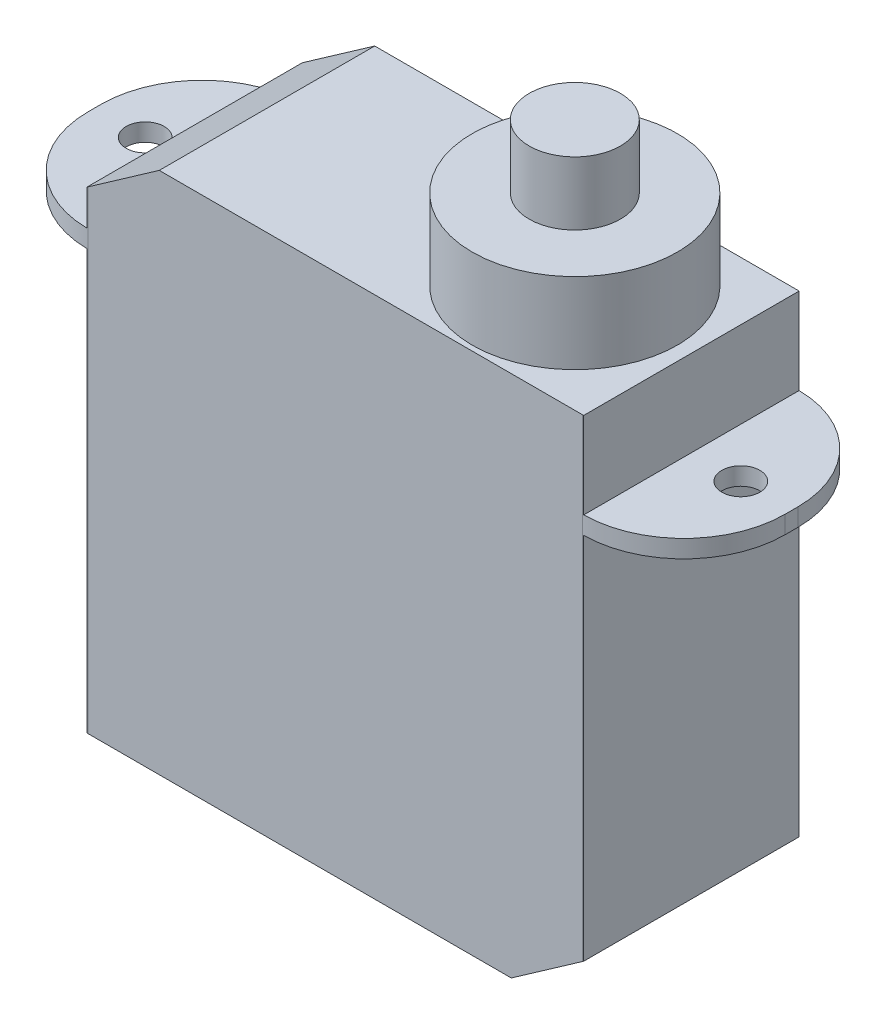
ISO-10303-21;
HEADER;
FILE_DESCRIPTION(('STEP AP214'),'2;1');
FILE_NAME('part.step','',(''),(''),'','','');
FILE_SCHEMA(('AUTOMOTIVE_DESIGN { 1 0 10303 214 1 1 1 1 }'));
ENDSEC;
DATA;
#1=APPLICATION_CONTEXT('core data for automotive mechanical design processes');
#2=APPLICATION_PROTOCOL_DEFINITION('international standard','automotive_design',2000,#1);
#3=PRODUCT_CONTEXT('',#1,'mechanical');
#4=PRODUCT('Part','Part','',(#3));
#5=PRODUCT_RELATED_PRODUCT_CATEGORY('part','',(#4));
#6=PRODUCT_DEFINITION_FORMATION('','',#4);
#7=PRODUCT_DEFINITION_CONTEXT('part definition',#1,'design');
#8=PRODUCT_DEFINITION('design','',#6,#7);
#9=PRODUCT_DEFINITION_SHAPE('','',#8);
#10=(LENGTH_UNIT() NAMED_UNIT(*) SI_UNIT(.MILLI.,.METRE.));
#11=(NAMED_UNIT(*) PLANE_ANGLE_UNIT() SI_UNIT($,.RADIAN.));
#12=(NAMED_UNIT(*) SI_UNIT($,.STERADIAN.) SOLID_ANGLE_UNIT());
#13=UNCERTAINTY_MEASURE_WITH_UNIT(LENGTH_MEASURE(1.E-05),#10,'distance_accuracy_value','');
#14=(GEOMETRIC_REPRESENTATION_CONTEXT(3) GLOBAL_UNCERTAINTY_ASSIGNED_CONTEXT((#13)) GLOBAL_UNIT_ASSIGNED_CONTEXT((#10,
#11,#12)) REPRESENTATION_CONTEXT('',''));
#15=CARTESIAN_POINT('',(0.,0.,0.));
#16=DIRECTION('',(0.,0.,1.));
#17=DIRECTION('',(1.,0.,0.));
#18=AXIS2_PLACEMENT_3D('',#15,#16,#17);
#19=CARTESIAN_POINT('',(-9.8,3.4,-4.25));
#20=DIRECTION('',(1.,0.,0.));
#21=DIRECTION('',(0.,0.,-1.));
#22=AXIS2_PLACEMENT_3D('',#19,#20,#21);
#23=PLANE('',#22);
#24=DIRECTION('',(0.,-1.,0.));
#25=VECTOR('',#24,1.);
#26=CARTESIAN_POINT('',(-9.8,0.,4.24968748779202));
#27=LINE('',#26,#25);
#28=CARTESIAN_POINT('',(-9.8,0.,4.24968748779202));
#29=VERTEX_POINT('',#28);
#30=CARTESIAN_POINT('',(-9.8,1.39999999999999,4.24968748779202));
#31=VERTEX_POINT('',#30);
#32=EDGE_CURVE('E202',#29,#31,#27,.F.);
#33=ORIENTED_EDGE('',*,*,#32,.T.);
#34=DIRECTION('',(0.,0.,-1.));
#35=VECTOR('',#34,1.);
#36=CARTESIAN_POINT('',(-9.8,1.39999999999999,-4.24968748779201));
#37=LINE('',#36,#35);
#38=CARTESIAN_POINT('',(-9.8,1.39999999999999,-4.24968748779202));
#39=VERTEX_POINT('',#38);
#40=EDGE_CURVE('E49',#31,#39,#37,.T.);
#41=ORIENTED_EDGE('',*,*,#40,.T.);
#42=DIRECTION('',(0.,-1.,0.));
#43=VECTOR('',#42,1.);
#44=CARTESIAN_POINT('',(-9.8,3.4,-4.24968748779202));
#45=LINE('',#44,#43);
#46=CARTESIAN_POINT('',(-9.8,0.,-4.24968748779202));
#47=VERTEX_POINT('',#46);
#48=EDGE_CURVE('E204',#39,#47,#45,.T.);
#49=ORIENTED_EDGE('',*,*,#48,.T.);
#50=DIRECTION('',(0.,0.,-1.));
#51=VECTOR('',#50,1.);
#52=CARTESIAN_POINT('',(-9.8,0.,-4.25));
#53=LINE('',#52,#51);
#54=EDGE_CURVE('E319',#29,#47,#53,.T.);
#55=ORIENTED_EDGE('',*,*,#54,.F.);
#56=EDGE_LOOP('',(#33,#41,#49,#55));
#57=FACE_BOUND('',#56,.T.);
#58=ADVANCED_FACE('F40',(#57),#23,.F.);
#59=CARTESIAN_POINT('',(9.8,3.4,-4.25));
#60=DIRECTION('',(-1.,0.,0.));
#61=DIRECTION('',(0.,0.,1.));
#62=AXIS2_PLACEMENT_3D('',#59,#60,#61);
#63=PLANE('',#62);
#64=DIRECTION('',(0.,0.,1.));
#65=VECTOR('',#64,1.);
#66=CARTESIAN_POINT('',(9.8,0.,-4.25));
#67=LINE('',#66,#65);
#68=CARTESIAN_POINT('',(9.8,0.,-4.24968748779202));
#69=VERTEX_POINT('',#68);
#70=CARTESIAN_POINT('',(9.8,0.,4.24968748779202));
#71=VERTEX_POINT('',#70);
#72=EDGE_CURVE('E301',#69,#71,#67,.T.);
#73=ORIENTED_EDGE('',*,*,#72,.F.);
#74=DIRECTION('',(0.,-1.,0.));
#75=VECTOR('',#74,1.);
#76=CARTESIAN_POINT('',(9.8,0.,-4.24968748779202));
#77=LINE('',#76,#75);
#78=CARTESIAN_POINT('',(9.8,3.4,-4.24968748779202));
#79=VERTEX_POINT('',#78);
#80=EDGE_CURVE('E238',#69,#79,#77,.F.);
#81=ORIENTED_EDGE('',*,*,#80,.T.);
#82=DIRECTION('',(0.,0.,-1.));
#83=VECTOR('',#82,1.);
#84=CARTESIAN_POINT('',(9.8,3.4,-4.25));
#85=LINE('',#84,#83);
#86=CARTESIAN_POINT('',(9.8,3.4,4.24968748779202));
#87=VERTEX_POINT('',#86);
#88=EDGE_CURVE('E286',#87,#79,#85,.T.);
#89=ORIENTED_EDGE('',*,*,#88,.F.);
#90=DIRECTION('',(0.,-1.,0.));
#91=VECTOR('',#90,1.);
#92=CARTESIAN_POINT('',(9.8,3.4,4.24968748779202));
#93=LINE('',#92,#91);
#94=EDGE_CURVE('E236',#87,#71,#93,.T.);
#95=ORIENTED_EDGE('',*,*,#94,.T.);
#96=EDGE_LOOP('',(#73,#81,#89,#95));
#97=FACE_BOUND('',#96,.T.);
#98=ADVANCED_FACE('F370',(#97),#63,.F.);
#99=DIRECTION('',(0.,-1.,0.));
#100=VECTOR('',#99,1.);
#101=CARTESIAN_POINT('',(9.8,-0.7,4.24968748779202));
#102=LINE('',#101,#100);
#103=CARTESIAN_POINT('',(9.8,-0.7,4.24968748779202));
#104=VERTEX_POINT('',#103);
#105=CARTESIAN_POINT('',(9.8,-15.25,4.24968748779202));
#106=VERTEX_POINT('',#105);
#107=EDGE_CURVE('E240',#104,#106,#102,.T.);
#108=ORIENTED_EDGE('',*,*,#107,.T.);
#109=DIRECTION('',(0.,0.,-1.));
#110=VECTOR('',#109,1.);
#111=CARTESIAN_POINT('',(9.8,-15.25,-4.25));
#112=LINE('',#111,#110);
#113=CARTESIAN_POINT('',(9.8,-15.25,-4.24968748779202));
#114=VERTEX_POINT('',#113);
#115=EDGE_CURVE('E250',#106,#114,#112,.T.);
#116=ORIENTED_EDGE('',*,*,#115,.T.);
#117=DIRECTION('',(0.,-1.,0.));
#118=VECTOR('',#117,1.);
#119=CARTESIAN_POINT('',(9.8,-17.25,-4.24968748779202));
#120=LINE('',#119,#118);
#121=CARTESIAN_POINT('',(9.8,-0.7,-4.24968748779202));
#122=VERTEX_POINT('',#121);
#123=EDGE_CURVE('E243',#114,#122,#120,.F.);
#124=ORIENTED_EDGE('',*,*,#123,.T.);
#125=DIRECTION('',(0.,0.,1.));
#126=VECTOR('',#125,1.);
#127=CARTESIAN_POINT('',(9.8,-0.7,-4.25));
#128=LINE('',#127,#126);
#129=EDGE_CURVE('E300',#122,#104,#128,.T.);
#130=ORIENTED_EDGE('',*,*,#129,.T.);
#131=EDGE_LOOP('',(#108,#116,#124,#130));
#132=FACE_BOUND('',#131,.T.);
#133=ADVANCED_FACE('F375',(#132),#63,.F.);
#134=CARTESIAN_POINT('',(-9.8,3.4,-4.25));
#135=DIRECTION('',(0.,0.,1.));
#136=DIRECTION('',(1.,0.,0.));
#137=AXIS2_PLACEMENT_3D('',#134,#135,#136);
#138=PLANE('',#137);
#139=DIRECTION('',(0.,1.,0.));
#140=VECTOR('',#139,1.);
#141=CARTESIAN_POINT('',(9.75,-0.7,-4.25));
#142=LINE('',#141,#140);
#143=CARTESIAN_POINT('',(9.75,3.4,-4.25));
#144=VERTEX_POINT('',#143);
#145=CARTESIAN_POINT('',(9.75,-15.2850103769105,-4.25));
#146=VERTEX_POINT('',#145);
#147=EDGE_CURVE('E193',#144,#146,#142,.F.);
#148=ORIENTED_EDGE('',*,*,#147,.T.);
#149=DIRECTION('',(0.81915204428899,0.573576436351048,0.));
#150=VECTOR('',#149,1.);
#151=CARTESIAN_POINT('',(9.8,-15.25,-4.25));
#152=LINE('',#151,#150);
#153=CARTESIAN_POINT('',(6.94370398651578,-17.25,-4.25));
#154=VERTEX_POINT('',#153);
#155=EDGE_CURVE('E174',#146,#154,#152,.F.);
#156=ORIENTED_EDGE('',*,*,#155,.T.);
#157=DIRECTION('',(-1.,0.,0.));
#158=VECTOR('',#157,1.);
#159=CARTESIAN_POINT('',(-9.8,-17.25,-4.25));
#160=LINE('',#159,#158);
#161=CARTESIAN_POINT('',(-9.75,-17.25,-4.25));
#162=VERTEX_POINT('',#161);
#163=EDGE_CURVE('E166',#154,#162,#160,.T.);
#164=ORIENTED_EDGE('',*,*,#163,.T.);
#165=DIRECTION('',(0.,1.,0.));
#166=VECTOR('',#165,1.);
#167=CARTESIAN_POINT('',(-9.75,0.,-4.25));
#168=LINE('',#167,#166);
#169=CARTESIAN_POINT('',(-9.75,1.43501037691048,-4.25));
#170=VERTEX_POINT('',#169);
#171=EDGE_CURVE('E171',#162,#170,#168,.T.);
#172=ORIENTED_EDGE('',*,*,#171,.T.);
#173=DIRECTION('',(0.819152044288991,0.573576436351047,0.));
#174=VECTOR('',#173,1.);
#175=CARTESIAN_POINT('',(-6.94370398651577,3.4,-4.25));
#176=LINE('',#175,#174);
#177=CARTESIAN_POINT('',(-6.94370398651577,3.4,-4.25));
#178=VERTEX_POINT('',#177);
#179=EDGE_CURVE('E255',#170,#178,#176,.T.);
#180=ORIENTED_EDGE('',*,*,#179,.T.);
#181=DIRECTION('',(-1.,0.,0.));
#182=VECTOR('',#181,1.);
#183=CARTESIAN_POINT('',(-9.8,3.4,-4.25));
#184=LINE('',#183,#182);
#185=EDGE_CURVE('E278',#144,#178,#184,.T.);
#186=ORIENTED_EDGE('',*,*,#185,.F.);
#187=EDGE_LOOP('',(#148,#156,#164,#172,#180,#186));
#188=FACE_BOUND('',#187,.T.);
#189=ADVANCED_FACE('F169',(#188),#138,.F.);
#190=DIRECTION('',(0.,0.,-1.));
#191=VECTOR('',#190,1.);
#192=CARTESIAN_POINT('',(-9.8,-0.7,-4.25));
#193=LINE('',#192,#191);
#194=CARTESIAN_POINT('',(-9.8,-0.7,4.24968748779202));
#195=VERTEX_POINT('',#194);
#196=CARTESIAN_POINT('',(-9.8,-0.7,-4.24968748779202));
#197=VERTEX_POINT('',#196);
#198=EDGE_CURVE('E318',#195,#197,#193,.T.);
#199=ORIENTED_EDGE('',*,*,#198,.T.);
#200=DIRECTION('',(0.,-1.,0.));
#201=VECTOR('',#200,1.);
#202=CARTESIAN_POINT('',(-9.8,-0.7,-4.24968748779202));
#203=LINE('',#202,#201);
#204=CARTESIAN_POINT('',(-9.8,-17.25,-4.24968748779202));
#205=VERTEX_POINT('',#204);
#206=EDGE_CURVE('E221',#197,#205,#203,.T.);
#207=ORIENTED_EDGE('',*,*,#206,.T.);
#208=DIRECTION('',(0.,0.,1.));
#209=VECTOR('',#208,1.);
#210=CARTESIAN_POINT('',(-9.8,-17.25,-4.25));
#211=LINE('',#210,#209);
#212=CARTESIAN_POINT('',(-9.8,-17.25,4.24968748779202));
#213=VERTEX_POINT('',#212);
#214=EDGE_CURVE('E177',#205,#213,#211,.T.);
#215=ORIENTED_EDGE('',*,*,#214,.T.);
#216=DIRECTION('',(0.,-1.,0.));
#217=VECTOR('',#216,1.);
#218=CARTESIAN_POINT('',(-9.8,-17.25,4.24968748779202));
#219=LINE('',#218,#217);
#220=EDGE_CURVE('E219',#213,#195,#219,.F.);
#221=ORIENTED_EDGE('',*,*,#220,.T.);
#222=EDGE_LOOP('',(#199,#207,#215,#221));
#223=FACE_BOUND('',#222,.T.);
#224=ADVANCED_FACE('F367',(#223),#23,.F.);
#225=CARTESIAN_POINT('',(-9.8,3.4,4.25));
#226=DIRECTION('',(0.,0.,-1.));
#227=DIRECTION('',(-1.,0.,0.));
#228=AXIS2_PLACEMENT_3D('',#225,#226,#227);
#229=PLANE('',#228);
#230=DIRECTION('',(1.,0.,0.));
#231=VECTOR('',#230,1.);
#232=CARTESIAN_POINT('',(-9.8,-17.25,4.25));
#233=LINE('',#232,#231);
#234=CARTESIAN_POINT('',(-9.75,-17.25,4.25));
#235=VERTEX_POINT('',#234);
#236=CARTESIAN_POINT('',(6.94370398651578,-17.25,4.25));
#237=VERTEX_POINT('',#236);
#238=EDGE_CURVE('E291',#235,#237,#233,.T.);
#239=ORIENTED_EDGE('',*,*,#238,.T.);
#240=DIRECTION('',(-0.81915204428899,-0.573576436351048,0.));
#241=VECTOR('',#240,1.);
#242=CARTESIAN_POINT('',(9.8,-15.25,4.25));
#243=LINE('',#242,#241);
#244=CARTESIAN_POINT('',(9.75,-15.2850103769105,4.25));
#245=VERTEX_POINT('',#244);
#246=EDGE_CURVE('E262',#237,#245,#243,.F.);
#247=ORIENTED_EDGE('',*,*,#246,.T.);
#248=DIRECTION('',(0.,1.,0.));
#249=VECTOR('',#248,1.);
#250=CARTESIAN_POINT('',(9.75,0.,4.25));
#251=LINE('',#250,#249);
#252=CARTESIAN_POINT('',(9.75,3.4,4.25));
#253=VERTEX_POINT('',#252);
#254=EDGE_CURVE('E187',#245,#253,#251,.T.);
#255=ORIENTED_EDGE('',*,*,#254,.T.);
#256=DIRECTION('',(1.,0.,0.));
#257=VECTOR('',#256,1.);
#258=CARTESIAN_POINT('',(-9.8,3.4,4.25));
#259=LINE('',#258,#257);
#260=CARTESIAN_POINT('',(-6.94370398651577,3.4,4.25));
#261=VERTEX_POINT('',#260);
#262=EDGE_CURVE('E275',#261,#253,#259,.T.);
#263=ORIENTED_EDGE('',*,*,#262,.F.);
#264=DIRECTION('',(-0.819152044288991,-0.573576436351047,0.));
#265=VECTOR('',#264,1.);
#266=CARTESIAN_POINT('',(-6.94370398651577,3.4,4.25));
#267=LINE('',#266,#265);
#268=CARTESIAN_POINT('',(-9.75,1.43501037691048,4.25));
#269=VERTEX_POINT('',#268);
#270=EDGE_CURVE('E260',#261,#269,#267,.T.);
#271=ORIENTED_EDGE('',*,*,#270,.T.);
#272=DIRECTION('',(0.,1.,0.));
#273=VECTOR('',#272,1.);
#274=CARTESIAN_POINT('',(-9.75,-0.7,4.25));
#275=LINE('',#274,#273);
#276=EDGE_CURVE('E225',#269,#235,#275,.F.);
#277=ORIENTED_EDGE('',*,*,#276,.T.);
#278=EDGE_LOOP('',(#239,#247,#255,#263,#271,#277));
#279=FACE_BOUND('',#278,.T.);
#280=ADVANCED_FACE('F282',(#279),#229,.F.);
#281=CARTESIAN_POINT('',(0.,3.4,0.));
#282=DIRECTION('',(0.,1.,0.));
#283=DIRECTION('',(0.,0.,1.));
#284=AXIS2_PLACEMENT_3D('',#281,#282,#283);
#285=PLANE('',#284);
#286=CARTESIAN_POINT('',(5.2,3.4,0.));
#287=DIRECTION('',(0.,1.,0.));
#288=DIRECTION('',(0.,0.,1.));
#289=AXIS2_PLACEMENT_3D('',#286,#287,#288);
#290=CIRCLE('',#289,4.05);
#291=CARTESIAN_POINT('',(5.2,3.4,4.05));
#292=VERTEX_POINT('',#291);
#293=EDGE_CURVE('E197',#292,#292,#290,.T.);
#294=ORIENTED_EDGE('',*,*,#293,.F.);
#295=EDGE_LOOP('',(#294));
#296=FACE_BOUND('',#295,.T.);
#297=ORIENTED_EDGE('',*,*,#185,.T.);
#298=DIRECTION('',(0.,0.,1.));
#299=VECTOR('',#298,1.);
#300=CARTESIAN_POINT('',(-6.94370398651577,3.4,4.24968748779202));
#301=LINE('',#300,#299);
#302=EDGE_CURVE('E266',#178,#261,#301,.T.);
#303=ORIENTED_EDGE('',*,*,#302,.T.);
#304=ORIENTED_EDGE('',*,*,#262,.T.);
#305=CARTESIAN_POINT('',(9.75,3.4,0.25));
#306=DIRECTION('',(0.,1.,0.));
#307=DIRECTION('',(0.,0.,1.));
#308=AXIS2_PLACEMENT_3D('',#305,#306,#307);
#309=CIRCLE('',#308,4.);
#310=EDGE_CURVE('E192',#253,#87,#309,.T.);
#311=ORIENTED_EDGE('',*,*,#310,.T.);
#312=ORIENTED_EDGE('',*,*,#88,.T.);
#313=CARTESIAN_POINT('',(9.75,3.4,-0.25));
#314=DIRECTION('',(0.,1.,0.));
#315=DIRECTION('',(0.,0.,1.));
#316=AXIS2_PLACEMENT_3D('',#313,#314,#315);
#317=CIRCLE('',#316,4.);
#318=EDGE_CURVE('E195',#79,#144,#317,.T.);
#319=ORIENTED_EDGE('',*,*,#318,.T.);
#320=EDGE_LOOP('',(#297,#303,#304,#311,#312,#319));
#321=FACE_BOUND('',#320,.T.);
#322=ADVANCED_FACE('F274',(#296,#321),#285,.T.);
#323=CARTESIAN_POINT('',(0.,-17.25,0.));
#324=DIRECTION('',(0.,1.,0.));
#325=DIRECTION('',(0.,0.,1.));
#326=AXIS2_PLACEMENT_3D('',#323,#324,#325);
#327=PLANE('',#326);
#328=ORIENTED_EDGE('',*,*,#163,.F.);
#329=DIRECTION('',(0.,0.,1.));
#330=VECTOR('',#329,1.);
#331=CARTESIAN_POINT('',(6.94370398651578,-17.25,0.));
#332=LINE('',#331,#330);
#333=EDGE_CURVE('E258',#154,#237,#332,.T.);
#334=ORIENTED_EDGE('',*,*,#333,.T.);
#335=ORIENTED_EDGE('',*,*,#238,.F.);
#336=CARTESIAN_POINT('',(-9.75,-17.25,0.25));
#337=DIRECTION('',(0.,1.,0.));
#338=DIRECTION('',(0.,0.,1.));
#339=AXIS2_PLACEMENT_3D('',#336,#337,#338);
#340=CIRCLE('',#339,4.);
#341=EDGE_CURVE('E188',#235,#213,#340,.F.);
#342=ORIENTED_EDGE('',*,*,#341,.T.);
#343=ORIENTED_EDGE('',*,*,#214,.F.);
#344=CARTESIAN_POINT('',(-9.75,-17.25,-0.25));
#345=DIRECTION('',(0.,1.,0.));
#346=DIRECTION('',(0.,0.,1.));
#347=AXIS2_PLACEMENT_3D('',#344,#345,#346);
#348=CIRCLE('',#347,4.);
#349=EDGE_CURVE('E182',#205,#162,#348,.F.);
#350=ORIENTED_EDGE('',*,*,#349,.T.);
#351=EDGE_LOOP('',(#328,#334,#335,#342,#343,#350));
#352=FACE_BOUND('',#351,.T.);
#353=ADVANCED_FACE('F183',(#352),#327,.F.);
#354=CARTESIAN_POINT('',(5.2,6.58,0.));
#355=DIRECTION('',(0.,-1.,0.));
#356=DIRECTION('',(0.,0.,-1.));
#357=AXIS2_PLACEMENT_3D('',#354,#355,#356);
#358=CYLINDRICAL_SURFACE('',#357,4.05);
#359=CARTESIAN_POINT('',(5.2,6.58,0.));
#360=DIRECTION('',(0.,1.,0.));
#361=DIRECTION('',(0.,0.,1.));
#362=AXIS2_PLACEMENT_3D('',#359,#360,#361);
#363=CIRCLE('',#362,4.05);
#364=CARTESIAN_POINT('',(5.2,6.58,4.05));
#365=VERTEX_POINT('',#364);
#366=EDGE_CURVE('E178',#365,#365,#363,.T.);
#367=ORIENTED_EDGE('',*,*,#366,.F.);
#368=EDGE_LOOP('',(#367));
#369=FACE_BOUND('',#368,.T.);
#370=ORIENTED_EDGE('',*,*,#293,.T.);
#371=EDGE_LOOP('',(#370));
#372=FACE_BOUND('',#371,.T.);
#373=ADVANCED_FACE('F351',(#369,#372),#358,.T.);
#374=CARTESIAN_POINT('',(5.2,6.58,0.));
#375=DIRECTION('',(0.,1.,0.));
#376=DIRECTION('',(0.,0.,1.));
#377=AXIS2_PLACEMENT_3D('',#374,#375,#376);
#378=PLANE('',#377);
#379=CARTESIAN_POINT('',(5.2,6.58,0.));
#380=DIRECTION('',(0.,1.,0.));
#381=DIRECTION('',(0.,0.,1.));
#382=AXIS2_PLACEMENT_3D('',#379,#380,#381);
#383=CIRCLE('',#382,1.8);
#384=CARTESIAN_POINT('',(5.2,6.58,1.8));
#385=VERTEX_POINT('',#384);
#386=EDGE_CURVE('E249',#385,#385,#383,.T.);
#387=ORIENTED_EDGE('',*,*,#386,.F.);
#388=EDGE_LOOP('',(#387));
#389=FACE_BOUND('',#388,.T.);
#390=ORIENTED_EDGE('',*,*,#366,.T.);
#391=EDGE_LOOP('',(#390));
#392=FACE_BOUND('',#391,.T.);
#393=ADVANCED_FACE('F347',(#389,#392),#378,.T.);
#394=CARTESIAN_POINT('',(13.75,-0.7,-4.25));
#395=DIRECTION('',(1.,0.,0.));
#396=DIRECTION('',(0.,0.,-1.));
#397=AXIS2_PLACEMENT_3D('',#394,#395,#396);
#398=PLANE('',#397);
#399=DIRECTION('',(0.,0.,-1.));
#400=VECTOR('',#399,1.);
#401=CARTESIAN_POINT('',(13.75,-0.7,-4.25));
#402=LINE('',#401,#400);
#403=CARTESIAN_POINT('',(13.75,-0.7,0.25));
#404=VERTEX_POINT('',#403);
#405=CARTESIAN_POINT('',(13.75,-0.7,-0.25));
#406=VERTEX_POINT('',#405);
#407=EDGE_CURVE('E296',#404,#406,#402,.T.);
#408=ORIENTED_EDGE('',*,*,#407,.T.);
#409=DIRECTION('',(0.,1.,0.));
#410=VECTOR('',#409,1.);
#411=CARTESIAN_POINT('',(13.75,0.,-0.25));
#412=LINE('',#411,#410);
#413=CARTESIAN_POINT('',(13.75,0.,-0.25));
#414=VERTEX_POINT('',#413);
#415=EDGE_CURVE('E229',#406,#414,#412,.T.);
#416=ORIENTED_EDGE('',*,*,#415,.T.);
#417=DIRECTION('',(0.,0.,-1.));
#418=VECTOR('',#417,1.);
#419=CARTESIAN_POINT('',(13.75,0.,-4.25));
#420=LINE('',#419,#418);
#421=CARTESIAN_POINT('',(13.75,0.,0.25));
#422=VERTEX_POINT('',#421);
#423=EDGE_CURVE('E297',#422,#414,#420,.T.);
#424=ORIENTED_EDGE('',*,*,#423,.F.);
#425=DIRECTION('',(0.,1.,0.));
#426=VECTOR('',#425,1.);
#427=CARTESIAN_POINT('',(13.75,-0.7,0.25));
#428=LINE('',#427,#426);
#429=EDGE_CURVE('E227',#422,#404,#428,.F.);
#430=ORIENTED_EDGE('',*,*,#429,.T.);
#431=EDGE_LOOP('',(#408,#416,#424,#430));
#432=FACE_BOUND('',#431,.T.);
#433=ADVANCED_FACE('F350',(#432),#398,.T.);
#434=CARTESIAN_POINT('',(0.,-0.7,0.));
#435=DIRECTION('',(0.,1.,0.));
#436=DIRECTION('',(0.,0.,1.));
#437=AXIS2_PLACEMENT_3D('',#434,#435,#436);
#438=PLANE('',#437);
#439=CARTESIAN_POINT('',(11.75,-0.7,0.));
#440=DIRECTION('',(0.,1.,0.));
#441=DIRECTION('',(0.,0.,1.));
#442=AXIS2_PLACEMENT_3D('',#439,#440,#441);
#443=CIRCLE('',#442,0.75);
#444=CARTESIAN_POINT('',(11.75,-0.7,0.75));
#445=VERTEX_POINT('',#444);
#446=EDGE_CURVE('E304',#445,#445,#443,.T.);
#447=ORIENTED_EDGE('',*,*,#446,.T.);
#448=EDGE_LOOP('',(#447));
#449=FACE_BOUND('',#448,.T.);
#450=ORIENTED_EDGE('',*,*,#129,.F.);
#451=CARTESIAN_POINT('',(9.75,-0.7,-0.25));
#452=DIRECTION('',(0.,1.,0.));
#453=DIRECTION('',(0.,0.,1.));
#454=AXIS2_PLACEMENT_3D('',#451,#452,#453);
#455=CIRCLE('',#454,4.);
#456=EDGE_CURVE('E247',#122,#406,#455,.F.);
#457=ORIENTED_EDGE('',*,*,#456,.T.);
#458=ORIENTED_EDGE('',*,*,#407,.F.);
#459=CARTESIAN_POINT('',(9.75,-0.7,0.25));
#460=DIRECTION('',(0.,1.,0.));
#461=DIRECTION('',(0.,0.,1.));
#462=AXIS2_PLACEMENT_3D('',#459,#460,#461);
#463=CIRCLE('',#462,4.);
#464=EDGE_CURVE('E245',#404,#104,#463,.F.);
#465=ORIENTED_EDGE('',*,*,#464,.T.);
#466=EDGE_LOOP('',(#450,#457,#458,#465));
#467=FACE_BOUND('',#466,.T.);
#468=ADVANCED_FACE('F432',(#449,#467),#438,.F.);
#469=CARTESIAN_POINT('',(0.,0.,0.));
#470=DIRECTION('',(0.,1.,0.));
#471=DIRECTION('',(0.,0.,1.));
#472=AXIS2_PLACEMENT_3D('',#469,#470,#471);
#473=PLANE('',#472);
#474=CARTESIAN_POINT('',(11.75,0.,0.));
#475=DIRECTION('',(0.,1.,0.));
#476=DIRECTION('',(0.,0.,1.));
#477=AXIS2_PLACEMENT_3D('',#474,#475,#476);
#478=CIRCLE('',#477,0.75);
#479=CARTESIAN_POINT('',(11.75,0.,0.75));
#480=VERTEX_POINT('',#479);
#481=EDGE_CURVE('E309',#480,#480,#478,.T.);
#482=ORIENTED_EDGE('',*,*,#481,.F.);
#483=EDGE_LOOP('',(#482));
#484=FACE_BOUND('',#483,.T.);
#485=ORIENTED_EDGE('',*,*,#423,.T.);
#486=CARTESIAN_POINT('',(9.75,0.,-0.25));
#487=DIRECTION('',(0.,1.,0.));
#488=DIRECTION('',(0.,0.,1.));
#489=AXIS2_PLACEMENT_3D('',#486,#487,#488);
#490=CIRCLE('',#489,4.);
#491=EDGE_CURVE('E234',#414,#69,#490,.T.);
#492=ORIENTED_EDGE('',*,*,#491,.T.);
#493=ORIENTED_EDGE('',*,*,#72,.T.);
#494=CARTESIAN_POINT('',(9.75,0.,0.25));
#495=DIRECTION('',(0.,1.,0.));
#496=DIRECTION('',(0.,0.,1.));
#497=AXIS2_PLACEMENT_3D('',#494,#495,#496);
#498=CIRCLE('',#497,4.);
#499=EDGE_CURVE('E232',#71,#422,#498,.T.);
#500=ORIENTED_EDGE('',*,*,#499,.T.);
#501=EDGE_LOOP('',(#485,#492,#493,#500));
#502=FACE_BOUND('',#501,.T.);
#503=ADVANCED_FACE('F430',(#484,#502),#473,.T.);
#504=CARTESIAN_POINT('',(11.75,-0.7,0.));
#505=DIRECTION('',(0.,1.,0.));
#506=DIRECTION('',(0.,0.,1.));
#507=AXIS2_PLACEMENT_3D('',#504,#505,#506);
#508=CYLINDRICAL_SURFACE('',#507,0.75);
#509=ORIENTED_EDGE('',*,*,#446,.F.);
#510=EDGE_LOOP('',(#509));
#511=FACE_BOUND('',#510,.T.);
#512=ORIENTED_EDGE('',*,*,#481,.T.);
#513=EDGE_LOOP('',(#512));
#514=FACE_BOUND('',#513,.T.);
#515=ADVANCED_FACE('F440',(#511,#514),#508,.F.);
#516=CARTESIAN_POINT('',(-13.75,-0.7,-4.25));
#517=DIRECTION('',(-1.,0.,0.));
#518=DIRECTION('',(0.,0.,1.));
#519=AXIS2_PLACEMENT_3D('',#516,#517,#518);
#520=PLANE('',#519);
#521=DIRECTION('',(0.,0.,1.));
#522=VECTOR('',#521,1.);
#523=CARTESIAN_POINT('',(-13.75,0.,-4.25));
#524=LINE('',#523,#522);
#525=CARTESIAN_POINT('',(-13.75,0.,-0.25));
#526=VERTEX_POINT('',#525);
#527=CARTESIAN_POINT('',(-13.75,0.,0.25));
#528=VERTEX_POINT('',#527);
#529=EDGE_CURVE('E315',#526,#528,#524,.T.);
#530=ORIENTED_EDGE('',*,*,#529,.F.);
#531=DIRECTION('',(0.,1.,0.));
#532=VECTOR('',#531,1.);
#533=CARTESIAN_POINT('',(-13.75,-0.7,-0.25));
#534=LINE('',#533,#532);
#535=CARTESIAN_POINT('',(-13.75,-0.7,-0.25));
#536=VERTEX_POINT('',#535);
#537=EDGE_CURVE('E213',#526,#536,#534,.F.);
#538=ORIENTED_EDGE('',*,*,#537,.T.);
#539=DIRECTION('',(0.,0.,1.));
#540=VECTOR('',#539,1.);
#541=CARTESIAN_POINT('',(-13.75,-0.7,-4.25));
#542=LINE('',#541,#540);
#543=CARTESIAN_POINT('',(-13.75,-0.7,0.25));
#544=VERTEX_POINT('',#543);
#545=EDGE_CURVE('E312',#536,#544,#542,.T.);
#546=ORIENTED_EDGE('',*,*,#545,.T.);
#547=DIRECTION('',(0.,1.,0.));
#548=VECTOR('',#547,1.);
#549=CARTESIAN_POINT('',(-13.75,0.,0.25));
#550=LINE('',#549,#548);
#551=EDGE_CURVE('E210',#544,#528,#550,.T.);
#552=ORIENTED_EDGE('',*,*,#551,.T.);
#553=EDGE_LOOP('',(#530,#538,#546,#552));
#554=FACE_BOUND('',#553,.T.);
#555=ADVANCED_FACE('F396',(#554),#520,.T.);
#556=CARTESIAN_POINT('',(0.,-0.7,0.));
#557=DIRECTION('',(0.,-1.,0.));
#558=DIRECTION('',(0.,0.,-1.));
#559=AXIS2_PLACEMENT_3D('',#556,#557,#558);
#560=PLANE('',#559);
#561=CARTESIAN_POINT('',(-11.75,-0.7,0.));
#562=DIRECTION('',(0.,1.,0.));
#563=DIRECTION('',(0.,0.,1.));
#564=AXIS2_PLACEMENT_3D('',#561,#562,#563);
#565=CIRCLE('',#564,0.75);
#566=CARTESIAN_POINT('',(-11.75,-0.7,0.75));
#567=VERTEX_POINT('',#566);
#568=EDGE_CURVE('E322',#567,#567,#565,.T.);
#569=ORIENTED_EDGE('',*,*,#568,.T.);
#570=EDGE_LOOP('',(#569));
#571=FACE_BOUND('',#570,.T.);
#572=ORIENTED_EDGE('',*,*,#545,.F.);
#573=CARTESIAN_POINT('',(-9.75,-0.7,-0.25));
#574=DIRECTION('',(0.,-1.,0.));
#575=DIRECTION('',(0.,0.,-1.));
#576=AXIS2_PLACEMENT_3D('',#573,#574,#575);
#577=CIRCLE('',#576,4.);
#578=EDGE_CURVE('E217',#536,#197,#577,.T.);
#579=ORIENTED_EDGE('',*,*,#578,.T.);
#580=ORIENTED_EDGE('',*,*,#198,.F.);
#581=CARTESIAN_POINT('',(-9.75,-0.7,0.25));
#582=DIRECTION('',(0.,-1.,0.));
#583=DIRECTION('',(0.,0.,-1.));
#584=AXIS2_PLACEMENT_3D('',#581,#582,#583);
#585=CIRCLE('',#584,4.);
#586=EDGE_CURVE('E215',#195,#544,#585,.T.);
#587=ORIENTED_EDGE('',*,*,#586,.T.);
#588=EDGE_LOOP('',(#572,#579,#580,#587));
#589=FACE_BOUND('',#588,.T.);
#590=ADVANCED_FACE('F392',(#571,#589),#560,.T.);
#591=CARTESIAN_POINT('',(0.,0.,0.));
#592=DIRECTION('',(0.,-1.,0.));
#593=DIRECTION('',(0.,0.,-1.));
#594=AXIS2_PLACEMENT_3D('',#591,#592,#593);
#595=PLANE('',#594);
#596=CARTESIAN_POINT('',(-11.75,0.,0.));
#597=DIRECTION('',(0.,1.,0.));
#598=DIRECTION('',(0.,0.,1.));
#599=AXIS2_PLACEMENT_3D('',#596,#597,#598);
#600=CIRCLE('',#599,0.75);
#601=CARTESIAN_POINT('',(-11.75,0.,0.75));
#602=VERTEX_POINT('',#601);
#603=EDGE_CURVE('E327',#602,#602,#600,.T.);
#604=ORIENTED_EDGE('',*,*,#603,.F.);
#605=EDGE_LOOP('',(#604));
#606=FACE_BOUND('',#605,.T.);
#607=ORIENTED_EDGE('',*,*,#54,.T.);
#608=CARTESIAN_POINT('',(-9.75,0.,-0.25));
#609=DIRECTION('',(0.,-1.,0.));
#610=DIRECTION('',(0.,0.,-1.));
#611=AXIS2_PLACEMENT_3D('',#608,#609,#610);
#612=CIRCLE('',#611,4.);
#613=EDGE_CURVE('E208',#47,#526,#612,.F.);
#614=ORIENTED_EDGE('',*,*,#613,.T.);
#615=ORIENTED_EDGE('',*,*,#529,.T.);
#616=CARTESIAN_POINT('',(-9.75,0.,0.25));
#617=DIRECTION('',(0.,-1.,0.));
#618=DIRECTION('',(0.,0.,-1.));
#619=AXIS2_PLACEMENT_3D('',#616,#617,#618);
#620=CIRCLE('',#619,4.);
#621=EDGE_CURVE('E206',#528,#29,#620,.F.);
#622=ORIENTED_EDGE('',*,*,#621,.T.);
#623=EDGE_LOOP('',(#607,#614,#615,#622));
#624=FACE_BOUND('',#623,.T.);
#625=ADVANCED_FACE('F400',(#606,#624),#595,.F.);
#626=CARTESIAN_POINT('',(-11.75,-0.7,0.));
#627=DIRECTION('',(0.,1.,0.));
#628=DIRECTION('',(0.,0.,1.));
#629=AXIS2_PLACEMENT_3D('',#626,#627,#628);
#630=CYLINDRICAL_SURFACE('',#629,0.75);
#631=ORIENTED_EDGE('',*,*,#568,.F.);
#632=EDGE_LOOP('',(#631));
#633=FACE_BOUND('',#632,.T.);
#634=ORIENTED_EDGE('',*,*,#603,.T.);
#635=EDGE_LOOP('',(#634));
#636=FACE_BOUND('',#635,.T.);
#637=ADVANCED_FACE('F452',(#633,#636),#630,.F.);
#638=CARTESIAN_POINT('',(-9.75,3.4,-0.25));
#639=DIRECTION('',(0.,-1.,0.));
#640=DIRECTION('',(0.,0.,-1.));
#641=AXIS2_PLACEMENT_3D('',#638,#639,#640);
#642=CYLINDRICAL_SURFACE('',#641,4.);
#643=ORIENTED_EDGE('',*,*,#48,.F.);
#644=CARTESIAN_POINT('',(-9.75,1.43501037691048,-0.25));
#645=DIRECTION('',(-0.573576436351047,0.819152044288991,0.));
#646=DIRECTION('',(-0.819152044288991,-0.573576436351047,0.));
#647=AXIS2_PLACEMENT_3D('',#644,#645,#646);
#648=ELLIPSE('',#647,4.88309835504583,4.);
#649=EDGE_CURVE('E11',#39,#170,#648,.F.);
#650=ORIENTED_EDGE('',*,*,#649,.T.);
#651=ORIENTED_EDGE('',*,*,#171,.F.);
#652=ORIENTED_EDGE('',*,*,#349,.F.);
#653=ORIENTED_EDGE('',*,*,#206,.F.);
#654=ORIENTED_EDGE('',*,*,#578,.F.);
#655=ORIENTED_EDGE('',*,*,#537,.F.);
#656=ORIENTED_EDGE('',*,*,#613,.F.);
#657=EDGE_LOOP('',(#643,#650,#651,#652,#653,#654,#655,#656));
#658=FACE_BOUND('',#657,.T.);
#659=ADVANCED_FACE('F190',(#658),#642,.T.);
#660=CARTESIAN_POINT('',(-9.75,-0.7,0.25));
#661=DIRECTION('',(0.,-1.,0.));
#662=DIRECTION('',(0.,0.,-1.));
#663=AXIS2_PLACEMENT_3D('',#660,#661,#662);
#664=CYLINDRICAL_SURFACE('',#663,4.);
#665=ORIENTED_EDGE('',*,*,#276,.F.);
#666=CARTESIAN_POINT('',(-9.75,1.43501037691048,0.25));
#667=DIRECTION('',(-0.573576436351047,0.819152044288991,0.));
#668=DIRECTION('',(-0.819152044288991,-0.573576436351047,0.));
#669=AXIS2_PLACEMENT_3D('',#666,#667,#668);
#670=ELLIPSE('',#669,4.88309835504583,4.);
#671=EDGE_CURVE('E63',#269,#31,#670,.F.);
#672=ORIENTED_EDGE('',*,*,#671,.T.);
#673=ORIENTED_EDGE('',*,*,#32,.F.);
#674=ORIENTED_EDGE('',*,*,#621,.F.);
#675=ORIENTED_EDGE('',*,*,#551,.F.);
#676=ORIENTED_EDGE('',*,*,#586,.F.);
#677=ORIENTED_EDGE('',*,*,#220,.F.);
#678=ORIENTED_EDGE('',*,*,#341,.F.);
#679=EDGE_LOOP('',(#665,#672,#673,#674,#675,#676,#677,#678));
#680=FACE_BOUND('',#679,.T.);
#681=ADVANCED_FACE('F397',(#680),#664,.T.);
#682=CARTESIAN_POINT('',(9.75,-0.7,-0.25));
#683=DIRECTION('',(0.,-1.,0.));
#684=DIRECTION('',(0.,0.,-1.));
#685=AXIS2_PLACEMENT_3D('',#682,#683,#684);
#686=CYLINDRICAL_SURFACE('',#685,4.);
#687=ORIENTED_EDGE('',*,*,#123,.F.);
#688=CARTESIAN_POINT('',(9.75,-15.2850103769105,-0.25));
#689=DIRECTION('',(-0.573576436351048,0.81915204428899,0.));
#690=DIRECTION('',(-0.81915204428899,-0.573576436351048,0.));
#691=AXIS2_PLACEMENT_3D('',#688,#689,#690);
#692=ELLIPSE('',#691,4.88309835504583,4.);
#693=EDGE_CURVE('E253',#114,#146,#692,.T.);
#694=ORIENTED_EDGE('',*,*,#693,.T.);
#695=ORIENTED_EDGE('',*,*,#147,.F.);
#696=ORIENTED_EDGE('',*,*,#318,.F.);
#697=ORIENTED_EDGE('',*,*,#80,.F.);
#698=ORIENTED_EDGE('',*,*,#491,.F.);
#699=ORIENTED_EDGE('',*,*,#415,.F.);
#700=ORIENTED_EDGE('',*,*,#456,.F.);
#701=EDGE_LOOP('',(#687,#694,#695,#696,#697,#698,#699,#700));
#702=FACE_BOUND('',#701,.T.);
#703=ADVANCED_FACE('F405',(#702),#686,.T.);
#704=CARTESIAN_POINT('',(9.75,3.4,0.25));
#705=DIRECTION('',(0.,-1.,0.));
#706=DIRECTION('',(0.,0.,-1.));
#707=AXIS2_PLACEMENT_3D('',#704,#705,#706);
#708=CYLINDRICAL_SURFACE('',#707,4.);
#709=ORIENTED_EDGE('',*,*,#254,.F.);
#710=CARTESIAN_POINT('',(9.75,-15.2850103769105,0.25));
#711=DIRECTION('',(-0.573576436351048,0.81915204428899,0.));
#712=DIRECTION('',(-0.81915204428899,-0.573576436351048,0.));
#713=AXIS2_PLACEMENT_3D('',#710,#711,#712);
#714=ELLIPSE('',#713,4.88309835504583,4.);
#715=EDGE_CURVE('E264',#245,#106,#714,.T.);
#716=ORIENTED_EDGE('',*,*,#715,.T.);
#717=ORIENTED_EDGE('',*,*,#107,.F.);
#718=ORIENTED_EDGE('',*,*,#464,.F.);
#719=ORIENTED_EDGE('',*,*,#429,.F.);
#720=ORIENTED_EDGE('',*,*,#499,.F.);
#721=ORIENTED_EDGE('',*,*,#94,.F.);
#722=ORIENTED_EDGE('',*,*,#310,.F.);
#723=EDGE_LOOP('',(#709,#716,#717,#718,#719,#720,#721,#722));
#724=FACE_BOUND('',#723,.T.);
#725=ADVANCED_FACE('F343',(#724),#708,.T.);
#726=CARTESIAN_POINT('',(5.2,9.08,0.));
#727=DIRECTION('',(0.,-1.,0.));
#728=DIRECTION('',(0.,0.,-1.));
#729=AXIS2_PLACEMENT_3D('',#726,#727,#728);
#730=CYLINDRICAL_SURFACE('',#729,1.8);
#731=CARTESIAN_POINT('',(5.2,9.08,0.));
#732=DIRECTION('',(0.,1.,0.));
#733=DIRECTION('',(0.,0.,1.));
#734=AXIS2_PLACEMENT_3D('',#731,#732,#733);
#735=CIRCLE('',#734,1.8);
#736=CARTESIAN_POINT('',(5.2,9.08,1.8));
#737=VERTEX_POINT('',#736);
#738=EDGE_CURVE('E330',#737,#737,#735,.T.);
#739=ORIENTED_EDGE('',*,*,#738,.F.);
#740=EDGE_LOOP('',(#739));
#741=FACE_BOUND('',#740,.T.);
#742=ORIENTED_EDGE('',*,*,#386,.T.);
#743=EDGE_LOOP('',(#742));
#744=FACE_BOUND('',#743,.T.);
#745=ADVANCED_FACE('F340',(#741,#744),#730,.T.);
#746=CARTESIAN_POINT('',(5.2,9.08,0.));
#747=DIRECTION('',(0.,1.,0.));
#748=DIRECTION('',(0.,0.,1.));
#749=AXIS2_PLACEMENT_3D('',#746,#747,#748);
#750=PLANE('',#749);
#751=ORIENTED_EDGE('',*,*,#738,.T.);
#752=EDGE_LOOP('',(#751));
#753=FACE_BOUND('',#752,.T.);
#754=ADVANCED_FACE('F338',(#753),#750,.T.);
#755=CARTESIAN_POINT('',(9.8,-15.25,-4.25));
#756=DIRECTION('',(-0.573576436351048,0.81915204428899,0.));
#757=DIRECTION('',(0.,0.,-1.));
#758=AXIS2_PLACEMENT_3D('',#755,#756,#757);
#759=PLANE('',#758);
#760=ORIENTED_EDGE('',*,*,#246,.F.);
#761=ORIENTED_EDGE('',*,*,#333,.F.);
#762=ORIENTED_EDGE('',*,*,#155,.F.);
#763=ORIENTED_EDGE('',*,*,#693,.F.);
#764=ORIENTED_EDGE('',*,*,#115,.F.);
#765=ORIENTED_EDGE('',*,*,#715,.F.);
#766=EDGE_LOOP('',(#760,#761,#762,#763,#764,#765));
#767=FACE_BOUND('',#766,.T.);
#768=ADVANCED_FACE('F411',(#767),#759,.F.);
#769=CARTESIAN_POINT('',(-6.94370398651577,3.4,0.));
#770=DIRECTION('',(-0.573576436351047,0.819152044288991,0.));
#771=DIRECTION('',(0.,0.,-1.));
#772=AXIS2_PLACEMENT_3D('',#769,#770,#771);
#773=PLANE('',#772);
#774=ORIENTED_EDGE('',*,*,#649,.F.);
#775=ORIENTED_EDGE('',*,*,#40,.F.);
#776=ORIENTED_EDGE('',*,*,#671,.F.);
#777=ORIENTED_EDGE('',*,*,#270,.F.);
#778=ORIENTED_EDGE('',*,*,#302,.F.);
#779=ORIENTED_EDGE('',*,*,#179,.F.);
#780=EDGE_LOOP('',(#774,#775,#776,#777,#778,#779));
#781=FACE_BOUND('',#780,.T.);
#782=ADVANCED_FACE('F43',(#781),#773,.T.);
#783=CLOSED_SHELL('',(#58,#98,#133,#189,#224,#280,#322,#353,#373,#393,#433,#468,#503,#515,#555,
#590,#625,#637,#659,#681,#703,#725,#745,#754,#768,#782));
#784=MANIFOLD_SOLID_BREP('B2',#783);
#785=ADVANCED_BREP_SHAPE_REPRESENTATION('',(#18,#784),#14);
#786=SHAPE_DEFINITION_REPRESENTATION(#9,#785);
ENDSEC;
END-ISO-10303-21;
